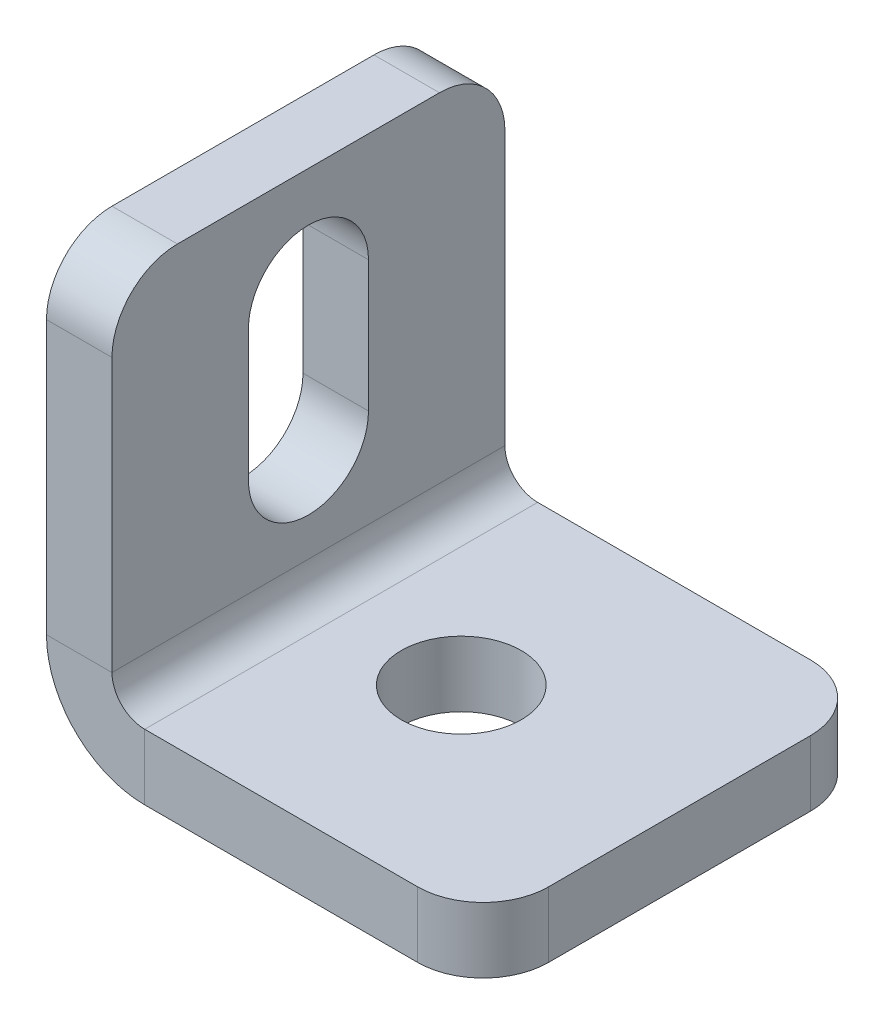
ISO-10303-21;
HEADER;
FILE_DESCRIPTION(('STEP AP214'),'2;1');
FILE_NAME('part.step','',(''),(''),'','','');
FILE_SCHEMA(('AUTOMOTIVE_DESIGN { 1 0 10303 214 1 1 1 1 }'));
ENDSEC;
DATA;
#1=APPLICATION_CONTEXT('core data for automotive mechanical design processes');
#2=APPLICATION_PROTOCOL_DEFINITION('international standard','automotive_design',2000,#1);
#3=PRODUCT_CONTEXT('',#1,'mechanical');
#4=PRODUCT('Part','Part','',(#3));
#5=PRODUCT_RELATED_PRODUCT_CATEGORY('part','',(#4));
#6=PRODUCT_DEFINITION_FORMATION('','',#4);
#7=PRODUCT_DEFINITION_CONTEXT('part definition',#1,'design');
#8=PRODUCT_DEFINITION('design','',#6,#7);
#9=PRODUCT_DEFINITION_SHAPE('','',#8);
#10=(LENGTH_UNIT() NAMED_UNIT(*) SI_UNIT(.MILLI.,.METRE.));
#11=(NAMED_UNIT(*) PLANE_ANGLE_UNIT() SI_UNIT($,.RADIAN.));
#12=(NAMED_UNIT(*) SI_UNIT($,.STERADIAN.) SOLID_ANGLE_UNIT());
#13=UNCERTAINTY_MEASURE_WITH_UNIT(LENGTH_MEASURE(1.E-05),#10,'distance_accuracy_value','');
#14=(GEOMETRIC_REPRESENTATION_CONTEXT(3) GLOBAL_UNCERTAINTY_ASSIGNED_CONTEXT((#13)) GLOBAL_UNIT_ASSIGNED_CONTEXT((#10,
#11,#12)) REPRESENTATION_CONTEXT('',''));
#15=CARTESIAN_POINT('',(0.,0.,0.));
#16=DIRECTION('',(0.,0.,1.));
#17=DIRECTION('',(1.,0.,0.));
#18=AXIS2_PLACEMENT_3D('',#15,#16,#17);
#19=CARTESIAN_POINT('',(3.,9.,0.));
#20=DIRECTION('',(1.,0.,0.));
#21=DIRECTION('',(0.,0.,-1.));
#22=AXIS2_PLACEMENT_3D('',#19,#20,#21);
#23=CYLINDRICAL_SURFACE('',#22,2.74999999999999);
#24=DIRECTION('',(1.,0.,0.));
#25=VECTOR('',#24,1.);
#26=CARTESIAN_POINT('',(0.,9.,2.74999999999999));
#27=LINE('',#26,#25);
#28=CARTESIAN_POINT('',(0.,9.,2.74999999999999));
#29=VERTEX_POINT('',#28);
#30=CARTESIAN_POINT('',(3.,9.,2.74999999999999));
#31=VERTEX_POINT('',#30);
#32=EDGE_CURVE('E215',#29,#31,#27,.T.);
#33=ORIENTED_EDGE('',*,*,#32,.T.);
#34=CARTESIAN_POINT('',(3.,9.,0.));
#35=DIRECTION('',(1.,0.,0.));
#36=DIRECTION('',(0.,0.,-1.));
#37=AXIS2_PLACEMENT_3D('',#34,#35,#36);
#38=CIRCLE('',#37,2.74999999999999);
#39=CARTESIAN_POINT('',(3.,9.,-2.74999999999999));
#40=VERTEX_POINT('',#39);
#41=EDGE_CURVE('E219',#31,#40,#38,.T.);
#42=ORIENTED_EDGE('',*,*,#41,.T.);
#43=DIRECTION('',(1.,0.,0.));
#44=VECTOR('',#43,1.);
#45=CARTESIAN_POINT('',(0.,9.,-2.74999999999999));
#46=LINE('',#45,#44);
#47=CARTESIAN_POINT('',(0.,9.,-2.75));
#48=VERTEX_POINT('',#47);
#49=EDGE_CURVE('E182',#48,#40,#46,.T.);
#50=ORIENTED_EDGE('',*,*,#49,.F.);
#51=CARTESIAN_POINT('',(0.,9.,0.));
#52=DIRECTION('',(1.,0.,0.));
#53=DIRECTION('',(0.,0.,-1.));
#54=AXIS2_PLACEMENT_3D('',#51,#52,#53);
#55=CIRCLE('',#54,2.75);
#56=EDGE_CURVE('E197',#29,#48,#55,.T.);
#57=ORIENTED_EDGE('',*,*,#56,.F.);
#58=EDGE_LOOP('',(#33,#42,#50,#57));
#59=FACE_BOUND('',#58,.T.);
#60=ADVANCED_FACE('F59',(#59),#23,.F.);
#61=CARTESIAN_POINT('',(0.,0.,9.));
#62=DIRECTION('',(0.,0.,-1.));
#63=DIRECTION('',(0.,-1.,0.));
#64=AXIS2_PLACEMENT_3D('',#61,#62,#63);
#65=PLANE('',#64);
#66=DIRECTION('',(0.,1.,0.));
#67=VECTOR('',#66,1.);
#68=CARTESIAN_POINT('',(3.,0.,9.));
#69=LINE('',#68,#67);
#70=CARTESIAN_POINT('',(3.,17.,9.));
#71=VERTEX_POINT('',#70);
#72=CARTESIAN_POINT('',(3.,4.5,9.));
#73=VERTEX_POINT('',#72);
#74=EDGE_CURVE('E294',#71,#73,#69,.F.);
#75=ORIENTED_EDGE('',*,*,#74,.F.);
#76=DIRECTION('',(1.,0.,0.));
#77=VECTOR('',#76,1.);
#78=CARTESIAN_POINT('',(0.,17.,9.));
#79=LINE('',#78,#77);
#80=CARTESIAN_POINT('',(0.,17.,9.));
#81=VERTEX_POINT('',#80);
#82=EDGE_CURVE('E13',#71,#81,#79,.F.);
#83=ORIENTED_EDGE('',*,*,#82,.T.);
#84=DIRECTION('',(0.,-1.,0.));
#85=VECTOR('',#84,1.);
#86=CARTESIAN_POINT('',(0.,0.,9.));
#87=LINE('',#86,#85);
#88=CARTESIAN_POINT('',(0.,4.5,9.));
#89=VERTEX_POINT('',#88);
#90=EDGE_CURVE('E230',#81,#89,#87,.T.);
#91=ORIENTED_EDGE('',*,*,#90,.T.);
#92=DIRECTION('',(-1.,0.,0.));
#93=VECTOR('',#92,1.);
#94=CARTESIAN_POINT('',(0.,4.5,9.));
#95=LINE('',#94,#93);
#96=EDGE_CURVE('E312',#73,#89,#95,.T.);
#97=ORIENTED_EDGE('',*,*,#96,.F.);
#98=EDGE_LOOP('',(#75,#83,#91,#97));
#99=FACE_BOUND('',#98,.T.);
#100=ADVANCED_FACE('F392',(#99),#65,.F.);
#101=CARTESIAN_POINT('',(0.,20.,-9.));
#102=DIRECTION('',(0.,-1.,0.));
#103=DIRECTION('',(0.,0.,1.));
#104=AXIS2_PLACEMENT_3D('',#101,#102,#103);
#105=PLANE('',#104);
#106=DIRECTION('',(0.,0.,1.));
#107=VECTOR('',#106,1.);
#108=CARTESIAN_POINT('',(3.,20.,-9.));
#109=LINE('',#108,#107);
#110=CARTESIAN_POINT('',(3.,20.,-6.));
#111=VERTEX_POINT('',#110);
#112=CARTESIAN_POINT('',(3.,20.,6.));
#113=VERTEX_POINT('',#112);
#114=EDGE_CURVE('E297',#111,#113,#109,.T.);
#115=ORIENTED_EDGE('',*,*,#114,.F.);
#116=DIRECTION('',(-1.,0.,0.));
#117=VECTOR('',#116,1.);
#118=CARTESIAN_POINT('',(0.,20.,-6.));
#119=LINE('',#118,#117);
#120=CARTESIAN_POINT('',(0.,20.,-6.));
#121=VERTEX_POINT('',#120);
#122=EDGE_CURVE('E347',#111,#121,#119,.T.);
#123=ORIENTED_EDGE('',*,*,#122,.T.);
#124=DIRECTION('',(0.,0.,1.));
#125=VECTOR('',#124,1.);
#126=CARTESIAN_POINT('',(0.,20.,-9.));
#127=LINE('',#126,#125);
#128=CARTESIAN_POINT('',(0.,20.,6.));
#129=VERTEX_POINT('',#128);
#130=EDGE_CURVE('E233',#121,#129,#127,.T.);
#131=ORIENTED_EDGE('',*,*,#130,.T.);
#132=DIRECTION('',(1.,0.,0.));
#133=VECTOR('',#132,1.);
#134=CARTESIAN_POINT('',(0.,20.,6.));
#135=LINE('',#134,#133);
#136=EDGE_CURVE('E344',#129,#113,#135,.T.);
#137=ORIENTED_EDGE('',*,*,#136,.T.);
#138=EDGE_LOOP('',(#115,#123,#131,#137));
#139=FACE_BOUND('',#138,.T.);
#140=ADVANCED_FACE('F372',(#139),#105,.F.);
#141=CARTESIAN_POINT('',(0.,0.,-9.));
#142=DIRECTION('',(0.,0.,-1.));
#143=DIRECTION('',(0.,-1.,0.));
#144=AXIS2_PLACEMENT_3D('',#141,#142,#143);
#145=PLANE('',#144);
#146=DIRECTION('',(0.,-1.,0.));
#147=VECTOR('',#146,1.);
#148=CARTESIAN_POINT('',(0.,0.,-9.));
#149=LINE('',#148,#147);
#150=CARTESIAN_POINT('',(0.,17.,-9.));
#151=VERTEX_POINT('',#150);
#152=CARTESIAN_POINT('',(0.,4.5,-9.));
#153=VERTEX_POINT('',#152);
#154=EDGE_CURVE('E238',#151,#153,#149,.T.);
#155=ORIENTED_EDGE('',*,*,#154,.F.);
#156=DIRECTION('',(1.,0.,0.));
#157=VECTOR('',#156,1.);
#158=CARTESIAN_POINT('',(0.,17.,-9.));
#159=LINE('',#158,#157);
#160=CARTESIAN_POINT('',(3.,17.,-9.));
#161=VERTEX_POINT('',#160);
#162=EDGE_CURVE('E357',#151,#161,#159,.T.);
#163=ORIENTED_EDGE('',*,*,#162,.T.);
#164=DIRECTION('',(0.,1.,0.));
#165=VECTOR('',#164,1.);
#166=CARTESIAN_POINT('',(3.,0.,-9.));
#167=LINE('',#166,#165);
#168=CARTESIAN_POINT('',(3.,4.5,-9.));
#169=VERTEX_POINT('',#168);
#170=EDGE_CURVE('E286',#161,#169,#167,.F.);
#171=ORIENTED_EDGE('',*,*,#170,.T.);
#172=DIRECTION('',(-1.,0.,0.));
#173=VECTOR('',#172,1.);
#174=CARTESIAN_POINT('',(0.,4.5,-9.));
#175=LINE('',#174,#173);
#176=EDGE_CURVE('E308',#169,#153,#175,.T.);
#177=ORIENTED_EDGE('',*,*,#176,.T.);
#178=EDGE_LOOP('',(#155,#163,#171,#177));
#179=FACE_BOUND('',#178,.T.);
#180=ADVANCED_FACE('F378',(#179),#145,.T.);
#181=CARTESIAN_POINT('',(4.5,4.5,-9.));
#182=DIRECTION('',(0.,0.,1.));
#183=DIRECTION('',(1.,0.,0.));
#184=AXIS2_PLACEMENT_3D('',#181,#182,#183);
#185=PLANE('',#184);
#186=ORIENTED_EDGE('',*,*,#176,.F.);
#187=CARTESIAN_POINT('',(4.5,4.5,-9.));
#188=DIRECTION('',(0.,0.,1.));
#189=DIRECTION('',(1.,0.,0.));
#190=AXIS2_PLACEMENT_3D('',#187,#188,#189);
#191=CIRCLE('',#190,1.5);
#192=CARTESIAN_POINT('',(4.5,3.,-9.));
#193=VERTEX_POINT('',#192);
#194=EDGE_CURVE('E290',#169,#193,#191,.T.);
#195=ORIENTED_EDGE('',*,*,#194,.T.);
#196=DIRECTION('',(0.,-1.,0.));
#197=VECTOR('',#196,1.);
#198=CARTESIAN_POINT('',(4.5,0.,-9.));
#199=LINE('',#198,#197);
#200=CARTESIAN_POINT('',(4.5,0.,-9.));
#201=VERTEX_POINT('',#200);
#202=EDGE_CURVE('E305',#193,#201,#199,.T.);
#203=ORIENTED_EDGE('',*,*,#202,.T.);
#204=CARTESIAN_POINT('',(4.5,4.5,-9.));
#205=DIRECTION('',(0.,0.,-1.));
#206=DIRECTION('',(-1.,0.,0.));
#207=AXIS2_PLACEMENT_3D('',#204,#205,#206);
#208=CIRCLE('',#207,4.5);
#209=EDGE_CURVE('E234',#153,#201,#208,.F.);
#210=ORIENTED_EDGE('',*,*,#209,.F.);
#211=EDGE_LOOP('',(#186,#195,#203,#210));
#212=FACE_BOUND('',#211,.T.);
#213=ADVANCED_FACE('F383',(#212),#185,.F.);
#214=CARTESIAN_POINT('',(20.,0.,-9.));
#215=DIRECTION('',(0.,0.,-1.));
#216=DIRECTION('',(1.,0.,0.));
#217=AXIS2_PLACEMENT_3D('',#214,#215,#216);
#218=PLANE('',#217);
#219=DIRECTION('',(1.,0.,0.));
#220=VECTOR('',#219,1.);
#221=CARTESIAN_POINT('',(20.,3.,-9.));
#222=LINE('',#221,#220);
#223=CARTESIAN_POINT('',(17.,3.,-9.));
#224=VERTEX_POINT('',#223);
#225=EDGE_CURVE('E277',#193,#224,#222,.T.);
#226=ORIENTED_EDGE('',*,*,#225,.T.);
#227=DIRECTION('',(0.,-1.,0.));
#228=VECTOR('',#227,1.);
#229=CARTESIAN_POINT('',(17.,0.,-9.));
#230=LINE('',#229,#228);
#231=CARTESIAN_POINT('',(17.,0.,-9.));
#232=VERTEX_POINT('',#231);
#233=EDGE_CURVE('E316',#224,#232,#230,.T.);
#234=ORIENTED_EDGE('',*,*,#233,.T.);
#235=DIRECTION('',(1.,0.,0.));
#236=VECTOR('',#235,1.);
#237=CARTESIAN_POINT('',(20.,0.,-9.));
#238=LINE('',#237,#236);
#239=EDGE_CURVE('E249',#201,#232,#238,.T.);
#240=ORIENTED_EDGE('',*,*,#239,.F.);
#241=ORIENTED_EDGE('',*,*,#202,.F.);
#242=EDGE_LOOP('',(#226,#234,#240,#241));
#243=FACE_BOUND('',#242,.T.);
#244=ADVANCED_FACE('F425',(#243),#218,.T.);
#245=CARTESIAN_POINT('',(20.,0.,-9.));
#246=DIRECTION('',(1.,0.,0.));
#247=DIRECTION('',(0.,0.,1.));
#248=AXIS2_PLACEMENT_3D('',#245,#246,#247);
#249=PLANE('',#248);
#250=DIRECTION('',(0.,0.,1.));
#251=VECTOR('',#250,1.);
#252=CARTESIAN_POINT('',(20.,0.,-9.));
#253=LINE('',#252,#251);
#254=CARTESIAN_POINT('',(20.,0.,-6.));
#255=VERTEX_POINT('',#254);
#256=CARTESIAN_POINT('',(20.,0.,6.));
#257=VERTEX_POINT('',#256);
#258=EDGE_CURVE('E241',#255,#257,#253,.T.);
#259=ORIENTED_EDGE('',*,*,#258,.F.);
#260=DIRECTION('',(0.,-1.,0.));
#261=VECTOR('',#260,1.);
#262=CARTESIAN_POINT('',(20.,0.,-6.));
#263=LINE('',#262,#261);
#264=CARTESIAN_POINT('',(20.,3.,-6.));
#265=VERTEX_POINT('',#264);
#266=EDGE_CURVE('E332',#255,#265,#263,.F.);
#267=ORIENTED_EDGE('',*,*,#266,.T.);
#268=DIRECTION('',(0.,0.,1.));
#269=VECTOR('',#268,1.);
#270=CARTESIAN_POINT('',(20.,3.,-9.));
#271=LINE('',#270,#269);
#272=CARTESIAN_POINT('',(20.,3.,6.));
#273=VERTEX_POINT('',#272);
#274=EDGE_CURVE('E282',#265,#273,#271,.T.);
#275=ORIENTED_EDGE('',*,*,#274,.T.);
#276=DIRECTION('',(0.,1.,0.));
#277=VECTOR('',#276,1.);
#278=CARTESIAN_POINT('',(20.,0.,6.));
#279=LINE('',#278,#277);
#280=EDGE_CURVE('E328',#273,#257,#279,.F.);
#281=ORIENTED_EDGE('',*,*,#280,.T.);
#282=EDGE_LOOP('',(#259,#267,#275,#281));
#283=FACE_BOUND('',#282,.T.);
#284=ADVANCED_FACE('F416',(#283),#249,.T.);
#285=CARTESIAN_POINT('',(20.,0.,9.));
#286=DIRECTION('',(0.,0.,-1.));
#287=DIRECTION('',(1.,0.,0.));
#288=AXIS2_PLACEMENT_3D('',#285,#286,#287);
#289=PLANE('',#288);
#290=DIRECTION('',(1.,0.,0.));
#291=VECTOR('',#290,1.);
#292=CARTESIAN_POINT('',(20.,0.,9.));
#293=LINE('',#292,#291);
#294=CARTESIAN_POINT('',(4.5,0.,9.));
#295=VERTEX_POINT('',#294);
#296=CARTESIAN_POINT('',(17.,0.,9.));
#297=VERTEX_POINT('',#296);
#298=EDGE_CURVE('E245',#295,#297,#293,.T.);
#299=ORIENTED_EDGE('',*,*,#298,.T.);
#300=DIRECTION('',(0.,-1.,0.));
#301=VECTOR('',#300,1.);
#302=CARTESIAN_POINT('',(17.,0.,9.));
#303=LINE('',#302,#301);
#304=CARTESIAN_POINT('',(17.,3.,9.));
#305=VERTEX_POINT('',#304);
#306=EDGE_CURVE('E341',#297,#305,#303,.F.);
#307=ORIENTED_EDGE('',*,*,#306,.T.);
#308=DIRECTION('',(1.,0.,0.));
#309=VECTOR('',#308,1.);
#310=CARTESIAN_POINT('',(20.,3.,9.));
#311=LINE('',#310,#309);
#312=CARTESIAN_POINT('',(4.5,3.,9.));
#313=VERTEX_POINT('',#312);
#314=EDGE_CURVE('E278',#313,#305,#311,.T.);
#315=ORIENTED_EDGE('',*,*,#314,.F.);
#316=DIRECTION('',(0.,-1.,0.));
#317=VECTOR('',#316,1.);
#318=CARTESIAN_POINT('',(4.5,0.,9.));
#319=LINE('',#318,#317);
#320=EDGE_CURVE('E261',#313,#295,#319,.T.);
#321=ORIENTED_EDGE('',*,*,#320,.T.);
#322=EDGE_LOOP('',(#299,#307,#315,#321));
#323=FACE_BOUND('',#322,.T.);
#324=ADVANCED_FACE('F403',(#323),#289,.F.);
#325=CARTESIAN_POINT('',(4.5,4.5,9.));
#326=DIRECTION('',(0.,0.,-1.));
#327=DIRECTION('',(-1.,0.,0.));
#328=AXIS2_PLACEMENT_3D('',#325,#326,#327);
#329=PLANE('',#328);
#330=CARTESIAN_POINT('',(4.5,4.5,9.));
#331=DIRECTION('',(0.,0.,1.));
#332=DIRECTION('',(1.,0.,0.));
#333=AXIS2_PLACEMENT_3D('',#330,#331,#332);
#334=CIRCLE('',#333,1.5);
#335=EDGE_CURVE('E229',#313,#73,#334,.F.);
#336=ORIENTED_EDGE('',*,*,#335,.T.);
#337=ORIENTED_EDGE('',*,*,#96,.T.);
#338=CARTESIAN_POINT('',(4.5,4.5,9.));
#339=DIRECTION('',(0.,0.,1.));
#340=DIRECTION('',(1.,0.,0.));
#341=AXIS2_PLACEMENT_3D('',#338,#339,#340);
#342=CIRCLE('',#341,4.5);
#343=EDGE_CURVE('E262',#295,#89,#342,.F.);
#344=ORIENTED_EDGE('',*,*,#343,.F.);
#345=ORIENTED_EDGE('',*,*,#320,.F.);
#346=EDGE_LOOP('',(#336,#337,#344,#345));
#347=FACE_BOUND('',#346,.T.);
#348=ADVANCED_FACE('F395',(#347),#329,.F.);
#349=CARTESIAN_POINT('',(20.,0.,-9.));
#350=DIRECTION('',(0.,-1.,0.));
#351=DIRECTION('',(1.,0.,0.));
#352=AXIS2_PLACEMENT_3D('',#349,#350,#351);
#353=PLANE('',#352);
#354=CARTESIAN_POINT('',(10.,0.,0.));
#355=DIRECTION('',(0.,-1.,0.));
#356=DIRECTION('',(1.,0.,0.));
#357=AXIS2_PLACEMENT_3D('',#354,#355,#356);
#358=CIRCLE('',#357,2.75);
#359=CARTESIAN_POINT('',(12.75,0.,0.));
#360=VERTEX_POINT('',#359);
#361=EDGE_CURVE('E206',#360,#360,#358,.T.);
#362=ORIENTED_EDGE('',*,*,#361,.F.);
#363=EDGE_LOOP('',(#362));
#364=FACE_BOUND('',#363,.T.);
#365=ORIENTED_EDGE('',*,*,#239,.T.);
#366=CARTESIAN_POINT('',(17.,0.,-6.));
#367=DIRECTION('',(0.,-1.,0.));
#368=DIRECTION('',(1.,0.,0.));
#369=AXIS2_PLACEMENT_3D('',#366,#367,#368);
#370=CIRCLE('',#369,3.);
#371=EDGE_CURVE('E325',#232,#255,#370,.T.);
#372=ORIENTED_EDGE('',*,*,#371,.T.);
#373=ORIENTED_EDGE('',*,*,#258,.T.);
#374=CARTESIAN_POINT('',(17.,0.,6.));
#375=DIRECTION('',(0.,-1.,0.));
#376=DIRECTION('',(1.,0.,0.));
#377=AXIS2_PLACEMENT_3D('',#374,#375,#376);
#378=CIRCLE('',#377,3.);
#379=EDGE_CURVE('E322',#257,#297,#378,.T.);
#380=ORIENTED_EDGE('',*,*,#379,.T.);
#381=ORIENTED_EDGE('',*,*,#298,.F.);
#382=DIRECTION('',(0.,0.,1.));
#383=VECTOR('',#382,1.);
#384=CARTESIAN_POINT('',(4.5,0.,-9.));
#385=LINE('',#384,#383);
#386=EDGE_CURVE('E257',#295,#201,#385,.F.);
#387=ORIENTED_EDGE('',*,*,#386,.T.);
#388=EDGE_LOOP('',(#365,#372,#373,#380,#381,#387));
#389=FACE_BOUND('',#388,.T.);
#390=ADVANCED_FACE('F419',(#364,#389),#353,.T.);
#391=CARTESIAN_POINT('',(0.,0.,-9.));
#392=DIRECTION('',(-1.,0.,0.));
#393=DIRECTION('',(0.,0.,1.));
#394=AXIS2_PLACEMENT_3D('',#391,#392,#393);
#395=PLANE('',#394);
#396=DIRECTION('',(0.,-1.,0.));
#397=VECTOR('',#396,1.);
#398=CARTESIAN_POINT('',(0.,9.,2.74999999999999));
#399=LINE('',#398,#397);
#400=CARTESIAN_POINT('',(0.,15.,2.74999999999999));
#401=VERTEX_POINT('',#400);
#402=EDGE_CURVE('E191',#401,#29,#399,.T.);
#403=ORIENTED_EDGE('',*,*,#402,.T.);
#404=ORIENTED_EDGE('',*,*,#56,.T.);
#405=DIRECTION('',(0.,1.,0.));
#406=VECTOR('',#405,1.);
#407=CARTESIAN_POINT('',(0.,9.,-2.74999999999999));
#408=LINE('',#407,#406);
#409=CARTESIAN_POINT('',(0.,15.,-2.74999999999999));
#410=VERTEX_POINT('',#409);
#411=EDGE_CURVE('E75',#48,#410,#408,.T.);
#412=ORIENTED_EDGE('',*,*,#411,.T.);
#413=CARTESIAN_POINT('',(0.,15.,0.));
#414=DIRECTION('',(1.,0.,0.));
#415=DIRECTION('',(0.,0.,-1.));
#416=AXIS2_PLACEMENT_3D('',#413,#414,#415);
#417=CIRCLE('',#416,2.74999999999999);
#418=EDGE_CURVE('E185',#410,#401,#417,.T.);
#419=ORIENTED_EDGE('',*,*,#418,.T.);
#420=EDGE_LOOP('',(#403,#404,#412,#419));
#421=FACE_BOUND('',#420,.T.);
#422=ORIENTED_EDGE('',*,*,#130,.F.);
#423=CARTESIAN_POINT('',(0.,17.,-6.));
#424=DIRECTION('',(-1.,0.,0.));
#425=DIRECTION('',(0.,0.,1.));
#426=AXIS2_PLACEMENT_3D('',#423,#424,#425);
#427=CIRCLE('',#426,3.);
#428=EDGE_CURVE('E354',#121,#151,#427,.T.);
#429=ORIENTED_EDGE('',*,*,#428,.T.);
#430=ORIENTED_EDGE('',*,*,#154,.T.);
#431=DIRECTION('',(0.,0.,1.));
#432=VECTOR('',#431,1.);
#433=CARTESIAN_POINT('',(0.,4.5,-9.));
#434=LINE('',#433,#432);
#435=EDGE_CURVE('E253',#153,#89,#434,.T.);
#436=ORIENTED_EDGE('',*,*,#435,.T.);
#437=ORIENTED_EDGE('',*,*,#90,.F.);
#438=CARTESIAN_POINT('',(0.,17.,6.));
#439=DIRECTION('',(-1.,0.,0.));
#440=DIRECTION('',(0.,0.,1.));
#441=AXIS2_PLACEMENT_3D('',#438,#439,#440);
#442=CIRCLE('',#441,3.);
#443=EDGE_CURVE('E351',#81,#129,#442,.T.);
#444=ORIENTED_EDGE('',*,*,#443,.T.);
#445=EDGE_LOOP('',(#422,#429,#430,#436,#437,#444));
#446=FACE_BOUND('',#445,.T.);
#447=ADVANCED_FACE('F194',(#421,#446),#395,.T.);
#448=CARTESIAN_POINT('',(4.5,4.5,-9.));
#449=DIRECTION('',(0.,0.,1.));
#450=DIRECTION('',(1.,0.,0.));
#451=AXIS2_PLACEMENT_3D('',#448,#449,#450);
#452=CYLINDRICAL_SURFACE('',#451,4.5);
#453=ORIENTED_EDGE('',*,*,#209,.T.);
#454=ORIENTED_EDGE('',*,*,#386,.F.);
#455=ORIENTED_EDGE('',*,*,#343,.T.);
#456=ORIENTED_EDGE('',*,*,#435,.F.);
#457=EDGE_LOOP('',(#453,#454,#455,#456));
#458=FACE_BOUND('',#457,.T.);
#459=ADVANCED_FACE('F387',(#458),#452,.T.);
#460=CARTESIAN_POINT('',(20.,3.,-9.));
#461=DIRECTION('',(0.,-1.,0.));
#462=DIRECTION('',(1.,0.,0.));
#463=AXIS2_PLACEMENT_3D('',#460,#461,#462);
#464=PLANE('',#463);
#465=CARTESIAN_POINT('',(10.,3.,0.));
#466=DIRECTION('',(0.,1.,0.));
#467=DIRECTION('',(0.,0.,1.));
#468=AXIS2_PLACEMENT_3D('',#465,#466,#467);
#469=CIRCLE('',#468,2.75);
#470=CARTESIAN_POINT('',(10.,3.,2.75));
#471=VERTEX_POINT('',#470);
#472=EDGE_CURVE('E497',#471,#471,#469,.T.);
#473=ORIENTED_EDGE('',*,*,#472,.F.);
#474=EDGE_LOOP('',(#473));
#475=FACE_BOUND('',#474,.T.);
#476=ORIENTED_EDGE('',*,*,#274,.F.);
#477=CARTESIAN_POINT('',(17.,3.,-6.));
#478=DIRECTION('',(0.,-1.,0.));
#479=DIRECTION('',(1.,0.,0.));
#480=AXIS2_PLACEMENT_3D('',#477,#478,#479);
#481=CIRCLE('',#480,3.);
#482=EDGE_CURVE('E338',#265,#224,#481,.F.);
#483=ORIENTED_EDGE('',*,*,#482,.T.);
#484=ORIENTED_EDGE('',*,*,#225,.F.);
#485=DIRECTION('',(0.,0.,1.));
#486=VECTOR('',#485,1.);
#487=CARTESIAN_POINT('',(4.5,3.,-9.));
#488=LINE('',#487,#486);
#489=EDGE_CURVE('E266',#313,#193,#488,.F.);
#490=ORIENTED_EDGE('',*,*,#489,.F.);
#491=ORIENTED_EDGE('',*,*,#314,.T.);
#492=CARTESIAN_POINT('',(17.,3.,6.));
#493=DIRECTION('',(0.,-1.,0.));
#494=DIRECTION('',(1.,0.,0.));
#495=AXIS2_PLACEMENT_3D('',#492,#493,#494);
#496=CIRCLE('',#495,3.);
#497=EDGE_CURVE('E335',#305,#273,#496,.F.);
#498=ORIENTED_EDGE('',*,*,#497,.T.);
#499=EDGE_LOOP('',(#476,#483,#484,#490,#491,#498));
#500=FACE_BOUND('',#499,.T.);
#501=ADVANCED_FACE('F409',(#475,#500),#464,.F.);
#502=CARTESIAN_POINT('',(3.,0.,-9.));
#503=DIRECTION('',(-1.,0.,0.));
#504=DIRECTION('',(0.,0.,1.));
#505=AXIS2_PLACEMENT_3D('',#502,#503,#504);
#506=PLANE('',#505);
#507=ORIENTED_EDGE('',*,*,#41,.F.);
#508=DIRECTION('',(0.,-1.,0.));
#509=VECTOR('',#508,1.);
#510=CARTESIAN_POINT('',(3.,9.,2.74999999999999));
#511=LINE('',#510,#509);
#512=CARTESIAN_POINT('',(3.,15.,2.74999999999999));
#513=VERTEX_POINT('',#512);
#514=EDGE_CURVE('E199',#513,#31,#511,.T.);
#515=ORIENTED_EDGE('',*,*,#514,.F.);
#516=CARTESIAN_POINT('',(3.,15.,0.));
#517=DIRECTION('',(1.,0.,0.));
#518=DIRECTION('',(0.,0.,-1.));
#519=AXIS2_PLACEMENT_3D('',#516,#517,#518);
#520=CIRCLE('',#519,2.74999999999999);
#521=CARTESIAN_POINT('',(3.,15.,-2.74999999999999));
#522=VERTEX_POINT('',#521);
#523=EDGE_CURVE('E203',#522,#513,#520,.T.);
#524=ORIENTED_EDGE('',*,*,#523,.F.);
#525=DIRECTION('',(0.,1.,0.));
#526=VECTOR('',#525,1.);
#527=CARTESIAN_POINT('',(3.,9.,-2.74999999999999));
#528=LINE('',#527,#526);
#529=EDGE_CURVE('E176',#40,#522,#528,.T.);
#530=ORIENTED_EDGE('',*,*,#529,.F.);
#531=EDGE_LOOP('',(#507,#515,#524,#530));
#532=FACE_BOUND('',#531,.T.);
#533=ORIENTED_EDGE('',*,*,#170,.F.);
#534=CARTESIAN_POINT('',(3.,17.,-6.));
#535=DIRECTION('',(-1.,0.,0.));
#536=DIRECTION('',(0.,0.,1.));
#537=AXIS2_PLACEMENT_3D('',#534,#535,#536);
#538=CIRCLE('',#537,3.);
#539=EDGE_CURVE('E68',#161,#111,#538,.F.);
#540=ORIENTED_EDGE('',*,*,#539,.T.);
#541=ORIENTED_EDGE('',*,*,#114,.T.);
#542=CARTESIAN_POINT('',(3.,17.,6.));
#543=DIRECTION('',(-1.,0.,0.));
#544=DIRECTION('',(0.,0.,1.));
#545=AXIS2_PLACEMENT_3D('',#542,#543,#544);
#546=CIRCLE('',#545,3.);
#547=EDGE_CURVE('E83',#113,#71,#546,.F.);
#548=ORIENTED_EDGE('',*,*,#547,.T.);
#549=ORIENTED_EDGE('',*,*,#74,.T.);
#550=DIRECTION('',(0.,0.,1.));
#551=VECTOR('',#550,1.);
#552=CARTESIAN_POINT('',(3.,4.5,-9.));
#553=LINE('',#552,#551);
#554=EDGE_CURVE('E273',#169,#73,#553,.T.);
#555=ORIENTED_EDGE('',*,*,#554,.F.);
#556=EDGE_LOOP('',(#533,#540,#541,#548,#549,#555));
#557=FACE_BOUND('',#556,.T.);
#558=ADVANCED_FACE('F366',(#532,#557),#506,.F.);
#559=CARTESIAN_POINT('',(4.5,4.5,-9.));
#560=DIRECTION('',(0.,0.,1.));
#561=DIRECTION('',(1.,0.,0.));
#562=AXIS2_PLACEMENT_3D('',#559,#560,#561);
#563=CYLINDRICAL_SURFACE('',#562,1.5);
#564=ORIENTED_EDGE('',*,*,#194,.F.);
#565=ORIENTED_EDGE('',*,*,#554,.T.);
#566=ORIENTED_EDGE('',*,*,#335,.F.);
#567=ORIENTED_EDGE('',*,*,#489,.T.);
#568=EDGE_LOOP('',(#564,#565,#566,#567));
#569=FACE_BOUND('',#568,.T.);
#570=ADVANCED_FACE('F401',(#569),#563,.F.);
#571=CARTESIAN_POINT('',(17.,0.,-6.));
#572=DIRECTION('',(0.,-1.,0.));
#573=DIRECTION('',(1.,0.,0.));
#574=AXIS2_PLACEMENT_3D('',#571,#572,#573);
#575=CYLINDRICAL_SURFACE('',#574,3.);
#576=ORIENTED_EDGE('',*,*,#482,.F.);
#577=ORIENTED_EDGE('',*,*,#266,.F.);
#578=ORIENTED_EDGE('',*,*,#371,.F.);
#579=ORIENTED_EDGE('',*,*,#233,.F.);
#580=EDGE_LOOP('',(#576,#577,#578,#579));
#581=FACE_BOUND('',#580,.T.);
#582=ADVANCED_FACE('F423',(#581),#575,.T.);
#583=CARTESIAN_POINT('',(17.,0.,6.));
#584=DIRECTION('',(0.,1.,0.));
#585=DIRECTION('',(-1.,0.,0.));
#586=AXIS2_PLACEMENT_3D('',#583,#584,#585);
#587=CYLINDRICAL_SURFACE('',#586,3.);
#588=ORIENTED_EDGE('',*,*,#497,.F.);
#589=ORIENTED_EDGE('',*,*,#306,.F.);
#590=ORIENTED_EDGE('',*,*,#379,.F.);
#591=ORIENTED_EDGE('',*,*,#280,.F.);
#592=EDGE_LOOP('',(#588,#589,#590,#591));
#593=FACE_BOUND('',#592,.T.);
#594=ADVANCED_FACE('F413',(#593),#587,.T.);
#595=CARTESIAN_POINT('',(0.,17.,-6.));
#596=DIRECTION('',(1.,0.,0.));
#597=DIRECTION('',(0.,0.,-1.));
#598=AXIS2_PLACEMENT_3D('',#595,#596,#597);
#599=CYLINDRICAL_SURFACE('',#598,3.);
#600=ORIENTED_EDGE('',*,*,#539,.F.);
#601=ORIENTED_EDGE('',*,*,#162,.F.);
#602=ORIENTED_EDGE('',*,*,#428,.F.);
#603=ORIENTED_EDGE('',*,*,#122,.F.);
#604=EDGE_LOOP('',(#600,#601,#602,#603));
#605=FACE_BOUND('',#604,.T.);
#606=ADVANCED_FACE('F375',(#605),#599,.T.);
#607=CARTESIAN_POINT('',(0.,17.,6.));
#608=DIRECTION('',(-1.,0.,0.));
#609=DIRECTION('',(0.,0.,1.));
#610=AXIS2_PLACEMENT_3D('',#607,#608,#609);
#611=CYLINDRICAL_SURFACE('',#610,3.);
#612=ORIENTED_EDGE('',*,*,#547,.F.);
#613=ORIENTED_EDGE('',*,*,#136,.F.);
#614=ORIENTED_EDGE('',*,*,#443,.F.);
#615=ORIENTED_EDGE('',*,*,#82,.F.);
#616=EDGE_LOOP('',(#612,#613,#614,#615));
#617=FACE_BOUND('',#616,.T.);
#618=ADVANCED_FACE('F61',(#617),#611,.T.);
#619=CARTESIAN_POINT('',(0.,9.,2.74999999999999));
#620=DIRECTION('',(0.,0.,1.));
#621=DIRECTION('',(1.,0.,0.));
#622=AXIS2_PLACEMENT_3D('',#619,#620,#621);
#623=PLANE('',#622);
#624=ORIENTED_EDGE('',*,*,#514,.T.);
#625=ORIENTED_EDGE('',*,*,#32,.F.);
#626=ORIENTED_EDGE('',*,*,#402,.F.);
#627=DIRECTION('',(1.,0.,0.));
#628=VECTOR('',#627,1.);
#629=CARTESIAN_POINT('',(0.,15.,2.74999999999999));
#630=LINE('',#629,#628);
#631=EDGE_CURVE('E181',#401,#513,#630,.T.);
#632=ORIENTED_EDGE('',*,*,#631,.T.);
#633=EDGE_LOOP('',(#624,#625,#626,#632));
#634=FACE_BOUND('',#633,.T.);
#635=ADVANCED_FACE('F475',(#634),#623,.F.);
#636=CARTESIAN_POINT('',(0.,15.,0.));
#637=DIRECTION('',(1.,0.,0.));
#638=DIRECTION('',(0.,0.,-1.));
#639=AXIS2_PLACEMENT_3D('',#636,#637,#638);
#640=CYLINDRICAL_SURFACE('',#639,2.74999999999999);
#641=ORIENTED_EDGE('',*,*,#523,.T.);
#642=ORIENTED_EDGE('',*,*,#631,.F.);
#643=ORIENTED_EDGE('',*,*,#418,.F.);
#644=DIRECTION('',(1.,0.,0.));
#645=VECTOR('',#644,1.);
#646=CARTESIAN_POINT('',(0.,15.,-2.74999999999999));
#647=LINE('',#646,#645);
#648=EDGE_CURVE('E172',#410,#522,#647,.T.);
#649=ORIENTED_EDGE('',*,*,#648,.T.);
#650=EDGE_LOOP('',(#641,#642,#643,#649));
#651=FACE_BOUND('',#650,.T.);
#652=ADVANCED_FACE('F186',(#651),#640,.F.);
#653=CARTESIAN_POINT('',(0.,9.,-2.74999999999999));
#654=DIRECTION('',(0.,0.,-1.));
#655=DIRECTION('',(-1.,0.,0.));
#656=AXIS2_PLACEMENT_3D('',#653,#654,#655);
#657=PLANE('',#656);
#658=ORIENTED_EDGE('',*,*,#529,.T.);
#659=ORIENTED_EDGE('',*,*,#648,.F.);
#660=ORIENTED_EDGE('',*,*,#411,.F.);
#661=ORIENTED_EDGE('',*,*,#49,.T.);
#662=EDGE_LOOP('',(#658,#659,#660,#661));
#663=FACE_BOUND('',#662,.T.);
#664=ADVANCED_FACE('F174',(#663),#657,.F.);
#665=CARTESIAN_POINT('',(10.,3.,0.));
#666=DIRECTION('',(0.,1.,0.));
#667=DIRECTION('',(0.,0.,1.));
#668=AXIS2_PLACEMENT_3D('',#665,#666,#667);
#669=CYLINDRICAL_SURFACE('',#668,2.75);
#670=ORIENTED_EDGE('',*,*,#361,.T.);
#671=EDGE_LOOP('',(#670));
#672=FACE_BOUND('',#671,.T.);
#673=ORIENTED_EDGE('',*,*,#472,.T.);
#674=EDGE_LOOP('',(#673));
#675=FACE_BOUND('',#674,.T.);
#676=ADVANCED_FACE('F486',(#672,#675),#669,.F.);
#677=CLOSED_SHELL('',(#60,#100,#140,#180,#213,#244,#284,#324,#348,#390,#447,#459,#501,#558,#570,
#582,#594,#606,#618,#635,#652,#664,#676));
#678=MANIFOLD_SOLID_BREP('B2',#677);
#679=ADVANCED_BREP_SHAPE_REPRESENTATION('',(#18,#678),#14);
#680=SHAPE_DEFINITION_REPRESENTATION(#9,#679);
ENDSEC;
END-ISO-10303-21;
